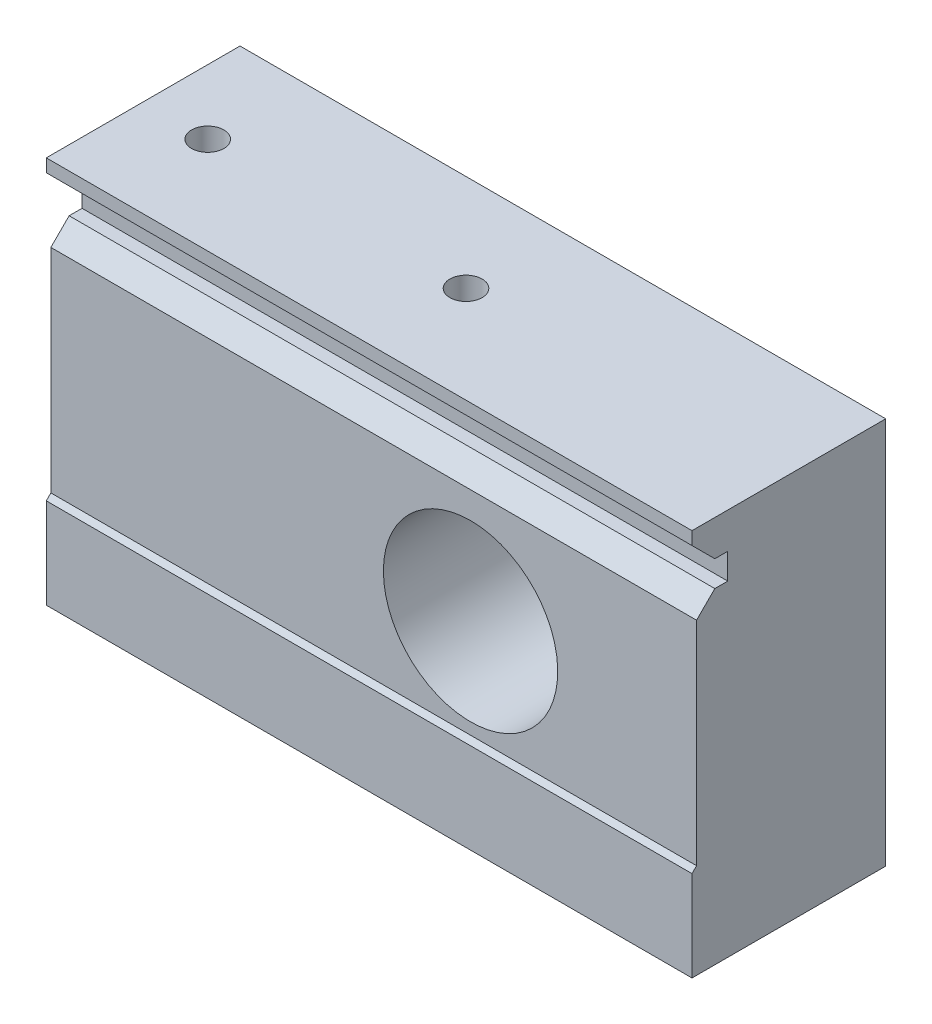
ISO-10303-21;
HEADER;
FILE_DESCRIPTION(('STEP AP214'),'2;1');
FILE_NAME('part.step','',(''),(''),'','','');
FILE_SCHEMA(('AUTOMOTIVE_DESIGN { 1 0 10303 214 1 1 1 1 }'));
ENDSEC;
DATA;
#1=APPLICATION_CONTEXT('core data for automotive mechanical design processes');
#2=APPLICATION_PROTOCOL_DEFINITION('international standard','automotive_design',2000,#1);
#3=PRODUCT_CONTEXT('',#1,'mechanical');
#4=PRODUCT('Part','Part','',(#3));
#5=PRODUCT_RELATED_PRODUCT_CATEGORY('part','',(#4));
#6=PRODUCT_DEFINITION_FORMATION('','',#4);
#7=PRODUCT_DEFINITION_CONTEXT('part definition',#1,'design');
#8=PRODUCT_DEFINITION('design','',#6,#7);
#9=PRODUCT_DEFINITION_SHAPE('','',#8);
#10=(LENGTH_UNIT() NAMED_UNIT(*) SI_UNIT(.MILLI.,.METRE.));
#11=(NAMED_UNIT(*) PLANE_ANGLE_UNIT() SI_UNIT($,.RADIAN.));
#12=(NAMED_UNIT(*) SI_UNIT($,.STERADIAN.) SOLID_ANGLE_UNIT());
#13=UNCERTAINTY_MEASURE_WITH_UNIT(LENGTH_MEASURE(1.E-05),#10,'distance_accuracy_value','');
#14=(GEOMETRIC_REPRESENTATION_CONTEXT(3) GLOBAL_UNCERTAINTY_ASSIGNED_CONTEXT((#13)) GLOBAL_UNIT_ASSIGNED_CONTEXT((#10,
#11,#12)) REPRESENTATION_CONTEXT('',''));
#15=CARTESIAN_POINT('',(0.,0.,0.));
#16=DIRECTION('',(0.,0.,1.));
#17=DIRECTION('',(1.,0.,0.));
#18=AXIS2_PLACEMENT_3D('',#15,#16,#17);
#19=CARTESIAN_POINT('',(0.,0.,30.));
#20=DIRECTION('',(0.,0.,1.));
#21=DIRECTION('',(1.,0.,0.));
#22=AXIS2_PLACEMENT_3D('',#19,#20,#21);
#23=PLANE('',#22);
#24=DIRECTION('',(1.,0.,0.));
#25=VECTOR('',#24,1.);
#26=CARTESIAN_POINT('',(0.,-16.4851485148515,30.));
#27=LINE('',#26,#25);
#28=CARTESIAN_POINT('',(-47.9207920792079,-16.4851485148515,30.));
#29=VERTEX_POINT('',#28);
#30=CARTESIAN_POINT('',(52.0792079207921,-16.4851485148515,30.));
#31=VERTEX_POINT('',#30);
#32=EDGE_CURVE('E158',#29,#31,#27,.T.);
#33=ORIENTED_EDGE('',*,*,#32,.F.);
#34=DIRECTION('',(0.,-1.,0.));
#35=VECTOR('',#34,1.);
#36=CARTESIAN_POINT('',(-47.9207920792079,29.5148514851485,30.));
#37=LINE('',#36,#35);
#38=CARTESIAN_POINT('',(-47.9207920792079,-30.4851485148515,30.));
#39=VERTEX_POINT('',#38);
#40=EDGE_CURVE('E105',#29,#39,#37,.T.);
#41=ORIENTED_EDGE('',*,*,#40,.T.);
#42=DIRECTION('',(1.,0.,0.));
#43=VECTOR('',#42,1.);
#44=CARTESIAN_POINT('',(-47.9207920792079,-30.4851485148515,30.));
#45=LINE('',#44,#43);
#46=CARTESIAN_POINT('',(52.0792079207921,-30.4851485148515,30.));
#47=VERTEX_POINT('',#46);
#48=EDGE_CURVE('E172',#39,#47,#45,.T.);
#49=ORIENTED_EDGE('',*,*,#48,.T.);
#50=DIRECTION('',(0.,1.,0.));
#51=VECTOR('',#50,1.);
#52=CARTESIAN_POINT('',(52.0792079207921,29.5148514851485,30.));
#53=LINE('',#52,#51);
#54=EDGE_CURVE('E182',#47,#31,#53,.T.);
#55=ORIENTED_EDGE('',*,*,#54,.T.);
#56=EDGE_LOOP('',(#33,#41,#49,#55));
#57=FACE_BOUND('',#56,.T.);
#58=ADVANCED_FACE('F50',(#57),#23,.T.);
#59=CARTESIAN_POINT('',(-47.9207920792079,29.5148514851485,30.));
#60=DIRECTION('',(1.,0.,0.));
#61=DIRECTION('',(0.,1.,0.));
#62=AXIS2_PLACEMENT_3D('',#59,#60,#61);
#63=PLANE('',#62);
#64=ORIENTED_EDGE('',*,*,#40,.F.);
#65=DIRECTION('',(0.,-0.707106781186546,0.707106781186549));
#66=VECTOR('',#65,1.);
#67=CARTESIAN_POINT('',(-47.9207920792079,-16.4851485148515,30.));
#68=LINE('',#67,#66);
#69=CARTESIAN_POINT('',(-47.9207920792079,-15.7780417336649,29.2928932188135));
#70=VERTEX_POINT('',#69);
#71=EDGE_CURVE('E261',#70,#29,#68,.T.);
#72=ORIENTED_EDGE('',*,*,#71,.F.);
#73=DIRECTION('',(0.,-1.,0.));
#74=VECTOR('',#73,1.);
#75=CARTESIAN_POINT('',(-47.9207920792079,-15.7780417336649,29.2928932188135));
#76=LINE('',#75,#74);
#77=CARTESIAN_POINT('',(-47.9207920792079,17.1508904544696,29.2928932188135));
#78=VERTEX_POINT('',#77);
#79=EDGE_CURVE('E271',#78,#70,#76,.T.);
#80=ORIENTED_EDGE('',*,*,#79,.F.);
#81=DIRECTION('',(0.,-0.707106781186546,0.707106781186549));
#82=VECTOR('',#81,1.);
#83=CARTESIAN_POINT('',(-47.9207920792079,17.1508904544696,29.2928932188135));
#84=LINE('',#83,#82);
#85=CARTESIAN_POINT('',(-47.9207920792079,19.9793175792158,26.4644660940673));
#86=VERTEX_POINT('',#85);
#87=EDGE_CURVE('E274',#86,#78,#84,.T.);
#88=ORIENTED_EDGE('',*,*,#87,.F.);
#89=DIRECTION('',(0.,0.,1.));
#90=VECTOR('',#89,1.);
#91=CARTESIAN_POINT('',(-47.9207920792079,19.9793175792158,26.4644660940673));
#92=LINE('',#91,#90);
#93=CARTESIAN_POINT('',(-47.9207920792079,19.9793175792158,24.4644660940673));
#94=VERTEX_POINT('',#93);
#95=EDGE_CURVE('E244',#94,#86,#92,.T.);
#96=ORIENTED_EDGE('',*,*,#95,.F.);
#97=DIRECTION('',(0.,-1.,0.));
#98=VECTOR('',#97,1.);
#99=CARTESIAN_POINT('',(-47.9207920792079,19.9793175792158,24.4644660940673));
#100=LINE('',#99,#98);
#101=CARTESIAN_POINT('',(-47.9207920792079,23.9793175792158,24.4644660940673));
#102=VERTEX_POINT('',#101);
#103=EDGE_CURVE('E279',#102,#94,#100,.T.);
#104=ORIENTED_EDGE('',*,*,#103,.F.);
#105=DIRECTION('',(0.,0.,-1.));
#106=VECTOR('',#105,1.);
#107=CARTESIAN_POINT('',(-47.9207920792079,23.9793175792158,24.4644660940673));
#108=LINE('',#107,#106);
#109=CARTESIAN_POINT('',(-47.9207920792079,23.9793175792158,26.4644660940673));
#110=VERTEX_POINT('',#109);
#111=EDGE_CURVE('E166',#110,#102,#108,.T.);
#112=ORIENTED_EDGE('',*,*,#111,.F.);
#113=DIRECTION('',(0.,-0.707106781186549,-0.707106781186546));
#114=VECTOR('',#113,1.);
#115=CARTESIAN_POINT('',(-47.9207920792079,23.9793175792158,26.4644660940673));
#116=LINE('',#115,#114);
#117=CARTESIAN_POINT('',(-47.9207920792079,27.5148514851485,30.));
#118=VERTEX_POINT('',#117);
#119=EDGE_CURVE('E154',#118,#110,#116,.T.);
#120=ORIENTED_EDGE('',*,*,#119,.F.);
#121=CARTESIAN_POINT('',(-47.9207920792079,29.5148514851485,30.));
#122=VERTEX_POINT('',#121);
#123=EDGE_CURVE('E163',#122,#118,#37,.T.);
#124=ORIENTED_EDGE('',*,*,#123,.F.);
#125=DIRECTION('',(0.,0.,-1.));
#126=VECTOR('',#125,1.);
#127=CARTESIAN_POINT('',(-47.9207920792079,29.5148514851485,30.));
#128=LINE('',#127,#126);
#129=CARTESIAN_POINT('',(-47.9207920792079,29.5148514851485,0.));
#130=VERTEX_POINT('',#129);
#131=EDGE_CURVE('E188',#122,#130,#128,.T.);
#132=ORIENTED_EDGE('',*,*,#131,.T.);
#133=DIRECTION('',(0.,-1.,0.));
#134=VECTOR('',#133,1.);
#135=CARTESIAN_POINT('',(-47.9207920792079,29.5148514851485,0.));
#136=LINE('',#135,#134);
#137=CARTESIAN_POINT('',(-47.9207920792079,-30.4851485148515,0.));
#138=VERTEX_POINT('',#137);
#139=EDGE_CURVE('E189',#130,#138,#136,.T.);
#140=ORIENTED_EDGE('',*,*,#139,.T.);
#141=DIRECTION('',(0.,0.,-1.));
#142=VECTOR('',#141,1.);
#143=CARTESIAN_POINT('',(-47.9207920792079,-30.4851485148515,30.));
#144=LINE('',#143,#142);
#145=EDGE_CURVE('E159',#39,#138,#144,.T.);
#146=ORIENTED_EDGE('',*,*,#145,.F.);
#147=EDGE_LOOP('',(#64,#72,#80,#88,#96,#104,#112,#120,#124,#132,#140,#146));
#148=FACE_BOUND('',#147,.T.);
#149=ADVANCED_FACE('F52',(#148),#63,.F.);
#150=CARTESIAN_POINT('',(-47.9207920792079,-30.4851485148515,30.));
#151=DIRECTION('',(0.,1.,0.));
#152=DIRECTION('',(0.,0.,1.));
#153=AXIS2_PLACEMENT_3D('',#150,#151,#152);
#154=PLANE('',#153);
#155=CARTESIAN_POINT('',(2.07920792079211,-30.4851485148515,15.));
#156=DIRECTION('',(0.,1.,0.));
#157=DIRECTION('',(0.,0.,1.));
#158=AXIS2_PLACEMENT_3D('',#155,#156,#157);
#159=CIRCLE('',#158,2.5);
#160=CARTESIAN_POINT('',(2.07920792079211,-30.4851485148515,17.5));
#161=VERTEX_POINT('',#160);
#162=EDGE_CURVE('E289',#161,#161,#159,.T.);
#163=ORIENTED_EDGE('',*,*,#162,.T.);
#164=EDGE_LOOP('',(#163));
#165=FACE_BOUND('',#164,.T.);
#166=CARTESIAN_POINT('',(-37.9207920792079,-30.4851485148515,15.));
#167=DIRECTION('',(0.,1.,0.));
#168=DIRECTION('',(0.,0.,1.));
#169=AXIS2_PLACEMENT_3D('',#166,#167,#168);
#170=CIRCLE('',#169,2.5);
#171=CARTESIAN_POINT('',(-37.9207920792079,-30.4851485148515,17.5));
#172=VERTEX_POINT('',#171);
#173=EDGE_CURVE('E298',#172,#172,#170,.T.);
#174=ORIENTED_EDGE('',*,*,#173,.T.);
#175=EDGE_LOOP('',(#174));
#176=FACE_BOUND('',#175,.T.);
#177=DIRECTION('',(1.,0.,0.));
#178=VECTOR('',#177,1.);
#179=CARTESIAN_POINT('',(-47.9207920792079,-30.4851485148515,0.));
#180=LINE('',#179,#178);
#181=CARTESIAN_POINT('',(52.0792079207921,-30.4851485148515,0.));
#182=VERTEX_POINT('',#181);
#183=EDGE_CURVE('E193',#138,#182,#180,.T.);
#184=ORIENTED_EDGE('',*,*,#183,.T.);
#185=DIRECTION('',(0.,0.,-1.));
#186=VECTOR('',#185,1.);
#187=CARTESIAN_POINT('',(52.0792079207921,-30.4851485148515,30.));
#188=LINE('',#187,#186);
#189=EDGE_CURVE('E206',#47,#182,#188,.T.);
#190=ORIENTED_EDGE('',*,*,#189,.F.);
#191=ORIENTED_EDGE('',*,*,#48,.F.);
#192=ORIENTED_EDGE('',*,*,#145,.T.);
#193=EDGE_LOOP('',(#184,#190,#191,#192));
#194=FACE_BOUND('',#193,.T.);
#195=ADVANCED_FACE('F330',(#165,#176,#194),#154,.F.);
#196=CARTESIAN_POINT('',(52.0792079207921,29.5148514851485,30.));
#197=DIRECTION('',(-1.,0.,0.));
#198=DIRECTION('',(0.,-1.,0.));
#199=AXIS2_PLACEMENT_3D('',#196,#197,#198);
#200=PLANE('',#199);
#201=DIRECTION('',(0.,-1.,0.));
#202=VECTOR('',#201,1.);
#203=CARTESIAN_POINT('',(52.0792079207921,29.5148514851485,29.2928932188135));
#204=LINE('',#203,#202);
#205=CARTESIAN_POINT('',(52.0792079207921,17.1508904544696,29.2928932188135));
#206=VERTEX_POINT('',#205);
#207=CARTESIAN_POINT('',(52.0792079207921,-15.7780417336649,29.2928932188135));
#208=VERTEX_POINT('',#207);
#209=EDGE_CURVE('E12',#206,#208,#204,.T.);
#210=ORIENTED_EDGE('',*,*,#209,.T.);
#211=DIRECTION('',(0.,-0.707106781186546,0.707106781186549));
#212=VECTOR('',#211,1.);
#213=CARTESIAN_POINT('',(52.0792079207921,6.51485148514841,7.00000000000001));
#214=LINE('',#213,#212);
#215=EDGE_CURVE('E179',#208,#31,#214,.T.);
#216=ORIENTED_EDGE('',*,*,#215,.T.);
#217=ORIENTED_EDGE('',*,*,#54,.F.);
#218=ORIENTED_EDGE('',*,*,#189,.T.);
#219=DIRECTION('',(0.,1.,0.));
#220=VECTOR('',#219,1.);
#221=CARTESIAN_POINT('',(52.0792079207921,29.5148514851485,0.));
#222=LINE('',#221,#220);
#223=CARTESIAN_POINT('',(52.0792079207921,29.5148514851485,0.));
#224=VERTEX_POINT('',#223);
#225=EDGE_CURVE('E196',#182,#224,#222,.T.);
#226=ORIENTED_EDGE('',*,*,#225,.T.);
#227=DIRECTION('',(0.,0.,-1.));
#228=VECTOR('',#227,1.);
#229=CARTESIAN_POINT('',(52.0792079207921,29.5148514851485,30.));
#230=LINE('',#229,#228);
#231=CARTESIAN_POINT('',(52.0792079207921,29.5148514851485,30.));
#232=VERTEX_POINT('',#231);
#233=EDGE_CURVE('E203',#232,#224,#230,.T.);
#234=ORIENTED_EDGE('',*,*,#233,.F.);
#235=CARTESIAN_POINT('',(52.0792079207921,27.5148514851485,30.));
#236=VERTEX_POINT('',#235);
#237=EDGE_CURVE('E176',#236,#232,#53,.T.);
#238=ORIENTED_EDGE('',*,*,#237,.F.);
#239=DIRECTION('',(0.,-0.707106781186549,-0.707106781186546));
#240=VECTOR('',#239,1.);
#241=CARTESIAN_POINT('',(52.0792079207921,28.5148514851485,31.));
#242=LINE('',#241,#240);
#243=CARTESIAN_POINT('',(52.0792079207921,23.9793175792158,26.4644660940673));
#244=VERTEX_POINT('',#243);
#245=EDGE_CURVE('E67',#236,#244,#242,.T.);
#246=ORIENTED_EDGE('',*,*,#245,.T.);
#247=DIRECTION('',(0.,0.,-1.));
#248=VECTOR('',#247,1.);
#249=CARTESIAN_POINT('',(52.0792079207921,23.9793175792158,30.));
#250=LINE('',#249,#248);
#251=CARTESIAN_POINT('',(52.0792079207921,23.9793175792158,24.4644660940673));
#252=VERTEX_POINT('',#251);
#253=EDGE_CURVE('E215',#244,#252,#250,.T.);
#254=ORIENTED_EDGE('',*,*,#253,.T.);
#255=DIRECTION('',(0.,-1.,0.));
#256=VECTOR('',#255,1.);
#257=CARTESIAN_POINT('',(52.0792079207921,29.5148514851485,24.4644660940673));
#258=LINE('',#257,#256);
#259=CARTESIAN_POINT('',(52.0792079207921,19.9793175792158,24.4644660940673));
#260=VERTEX_POINT('',#259);
#261=EDGE_CURVE('E219',#252,#260,#258,.T.);
#262=ORIENTED_EDGE('',*,*,#261,.T.);
#263=DIRECTION('',(0.,0.,1.));
#264=VECTOR('',#263,1.);
#265=CARTESIAN_POINT('',(52.0792079207921,19.9793175792158,30.));
#266=LINE('',#265,#264);
#267=CARTESIAN_POINT('',(52.0792079207921,19.9793175792158,26.4644660940673));
#268=VERTEX_POINT('',#267);
#269=EDGE_CURVE('E223',#260,#268,#266,.T.);
#270=ORIENTED_EDGE('',*,*,#269,.T.);
#271=DIRECTION('',(0.,-0.707106781186546,0.707106781186549));
#272=VECTOR('',#271,1.);
#273=CARTESIAN_POINT('',(52.0792079207921,22.9793175792158,23.4644660940673));
#274=LINE('',#273,#272);
#275=EDGE_CURVE('E60',#268,#206,#274,.T.);
#276=ORIENTED_EDGE('',*,*,#275,.T.);
#277=EDGE_LOOP('',(#210,#216,#217,#218,#226,#234,#238,#246,#254,#262,#270,#276));
#278=FACE_BOUND('',#277,.T.);
#279=ADVANCED_FACE('F230',(#278),#200,.F.);
#280=CARTESIAN_POINT('',(-47.9207920792079,29.5148514851485,30.));
#281=DIRECTION('',(0.,-1.,0.));
#282=DIRECTION('',(0.,0.,-1.));
#283=AXIS2_PLACEMENT_3D('',#280,#281,#282);
#284=PLANE('',#283);
#285=CARTESIAN_POINT('',(-37.9207920792079,29.5148514851485,15.));
#286=DIRECTION('',(0.,1.,0.));
#287=DIRECTION('',(0.,0.,1.));
#288=AXIS2_PLACEMENT_3D('',#285,#286,#287);
#289=CIRCLE('',#288,2.5);
#290=CARTESIAN_POINT('',(-37.9207920792079,29.5148514851485,17.5));
#291=VERTEX_POINT('',#290);
#292=EDGE_CURVE('E317',#291,#291,#289,.T.);
#293=ORIENTED_EDGE('',*,*,#292,.F.);
#294=EDGE_LOOP('',(#293));
#295=FACE_BOUND('',#294,.T.);
#296=CARTESIAN_POINT('',(2.07920792079211,29.5148514851485,15.));
#297=DIRECTION('',(0.,1.,0.));
#298=DIRECTION('',(0.,0.,1.));
#299=AXIS2_PLACEMENT_3D('',#296,#297,#298);
#300=CIRCLE('',#299,2.5);
#301=CARTESIAN_POINT('',(2.07920792079211,29.5148514851485,17.5));
#302=VERTEX_POINT('',#301);
#303=EDGE_CURVE('E285',#302,#302,#300,.T.);
#304=ORIENTED_EDGE('',*,*,#303,.F.);
#305=EDGE_LOOP('',(#304));
#306=FACE_BOUND('',#305,.T.);
#307=DIRECTION('',(-1.,0.,0.));
#308=VECTOR('',#307,1.);
#309=CARTESIAN_POINT('',(-47.9207920792079,29.5148514851485,0.));
#310=LINE('',#309,#308);
#311=EDGE_CURVE('E97',#224,#130,#310,.T.);
#312=ORIENTED_EDGE('',*,*,#311,.T.);
#313=ORIENTED_EDGE('',*,*,#131,.F.);
#314=DIRECTION('',(-1.,0.,0.));
#315=VECTOR('',#314,1.);
#316=CARTESIAN_POINT('',(-47.9207920792079,29.5148514851485,30.));
#317=LINE('',#316,#315);
#318=EDGE_CURVE('E76',#232,#122,#317,.T.);
#319=ORIENTED_EDGE('',*,*,#318,.F.);
#320=ORIENTED_EDGE('',*,*,#233,.T.);
#321=EDGE_LOOP('',(#312,#313,#319,#320));
#322=FACE_BOUND('',#321,.T.);
#323=ADVANCED_FACE('F360',(#295,#306,#322),#284,.F.);
#324=DIRECTION('',(-1.,0.,0.));
#325=VECTOR('',#324,1.);
#326=CARTESIAN_POINT('',(0.,27.5148514851485,30.));
#327=LINE('',#326,#325);
#328=EDGE_CURVE('E151',#236,#118,#327,.T.);
#329=ORIENTED_EDGE('',*,*,#328,.F.);
#330=ORIENTED_EDGE('',*,*,#237,.T.);
#331=ORIENTED_EDGE('',*,*,#318,.T.);
#332=ORIENTED_EDGE('',*,*,#123,.T.);
#333=EDGE_LOOP('',(#329,#330,#331,#332));
#334=FACE_BOUND('',#333,.T.);
#335=ADVANCED_FACE('F170',(#334),#23,.T.);
#336=CARTESIAN_POINT('',(0.,0.,0.));
#337=DIRECTION('',(0.,0.,1.));
#338=DIRECTION('',(1.,0.,0.));
#339=AXIS2_PLACEMENT_3D('',#336,#337,#338);
#340=PLANE('',#339);
#341=CARTESIAN_POINT('',(17.0792079207921,-0.485148514851486,0.));
#342=DIRECTION('',(0.,0.,-1.));
#343=DIRECTION('',(-1.,0.,0.));
#344=AXIS2_PLACEMENT_3D('',#341,#342,#343);
#345=CIRCLE('',#344,13.5);
#346=CARTESIAN_POINT('',(3.57920792079213,-0.485148514851486,0.));
#347=VERTEX_POINT('',#346);
#348=EDGE_CURVE('E309',#347,#347,#345,.T.);
#349=ORIENTED_EDGE('',*,*,#348,.F.);
#350=EDGE_LOOP('',(#349));
#351=FACE_BOUND('',#350,.T.);
#352=ORIENTED_EDGE('',*,*,#139,.F.);
#353=ORIENTED_EDGE('',*,*,#311,.F.);
#354=ORIENTED_EDGE('',*,*,#225,.F.);
#355=ORIENTED_EDGE('',*,*,#183,.F.);
#356=EDGE_LOOP('',(#352,#353,#354,#355));
#357=FACE_BOUND('',#356,.T.);
#358=ADVANCED_FACE('F359',(#351,#357),#340,.F.);
#359=CARTESIAN_POINT('',(62.0792079207921,-15.7780417336649,29.2928932188135));
#360=DIRECTION('',(0.,0.,-1.));
#361=DIRECTION('',(0.,1.,0.));
#362=AXIS2_PLACEMENT_3D('',#359,#360,#361);
#363=PLANE('',#362);
#364=CARTESIAN_POINT('',(17.0792079207921,-0.485148514851486,29.2928932188135));
#365=DIRECTION('',(0.,0.,-1.));
#366=DIRECTION('',(0.,1.,0.));
#367=AXIS2_PLACEMENT_3D('',#364,#365,#366);
#368=CIRCLE('',#367,13.5);
#369=CARTESIAN_POINT('',(17.0792079207921,13.0148514851485,29.2928932188135));
#370=VERTEX_POINT('',#369);
#371=EDGE_CURVE('E54',#370,#370,#368,.T.);
#372=ORIENTED_EDGE('',*,*,#371,.T.);
#373=EDGE_LOOP('',(#372));
#374=FACE_BOUND('',#373,.T.);
#375=DIRECTION('',(-1.,0.,0.));
#376=VECTOR('',#375,1.);
#377=CARTESIAN_POINT('',(62.0792079207921,17.1508904544696,29.2928932188135));
#378=LINE('',#377,#376);
#379=EDGE_CURVE('E239',#206,#78,#378,.T.);
#380=ORIENTED_EDGE('',*,*,#379,.T.);
#381=ORIENTED_EDGE('',*,*,#79,.T.);
#382=DIRECTION('',(-1.,0.,0.));
#383=VECTOR('',#382,1.);
#384=CARTESIAN_POINT('',(62.0792079207921,-15.7780417336649,29.2928932188135));
#385=LINE('',#384,#383);
#386=EDGE_CURVE('E251',#208,#70,#385,.T.);
#387=ORIENTED_EDGE('',*,*,#386,.F.);
#388=ORIENTED_EDGE('',*,*,#209,.F.);
#389=EDGE_LOOP('',(#380,#381,#387,#388));
#390=FACE_BOUND('',#389,.T.);
#391=ADVANCED_FACE('F365',(#374,#390),#363,.F.);
#392=CARTESIAN_POINT('',(62.0792079207921,17.1508904544696,29.2928932188135));
#393=DIRECTION('',(0.,-0.707106781186549,-0.707106781186546));
#394=DIRECTION('',(0.,0.707106781186546,-0.707106781186549));
#395=AXIS2_PLACEMENT_3D('',#392,#393,#394);
#396=PLANE('',#395);
#397=DIRECTION('',(-1.,0.,0.));
#398=VECTOR('',#397,1.);
#399=CARTESIAN_POINT('',(62.0792079207921,19.9793175792158,26.4644660940673));
#400=LINE('',#399,#398);
#401=EDGE_CURVE('E237',#268,#86,#400,.T.);
#402=ORIENTED_EDGE('',*,*,#401,.T.);
#403=ORIENTED_EDGE('',*,*,#87,.T.);
#404=ORIENTED_EDGE('',*,*,#379,.F.);
#405=ORIENTED_EDGE('',*,*,#275,.F.);
#406=EDGE_LOOP('',(#402,#403,#404,#405));
#407=FACE_BOUND('',#406,.T.);
#408=ADVANCED_FACE('F235',(#407),#396,.F.);
#409=CARTESIAN_POINT('',(62.0792079207921,19.9793175792158,26.4644660940673));
#410=DIRECTION('',(0.,-1.,0.));
#411=DIRECTION('',(0.,0.,-1.));
#412=AXIS2_PLACEMENT_3D('',#409,#410,#411);
#413=PLANE('',#412);
#414=DIRECTION('',(-1.,0.,0.));
#415=VECTOR('',#414,1.);
#416=CARTESIAN_POINT('',(62.0792079207921,19.9793175792158,24.4644660940673));
#417=LINE('',#416,#415);
#418=EDGE_CURVE('E247',#260,#94,#417,.T.);
#419=ORIENTED_EDGE('',*,*,#418,.T.);
#420=ORIENTED_EDGE('',*,*,#95,.T.);
#421=ORIENTED_EDGE('',*,*,#401,.F.);
#422=ORIENTED_EDGE('',*,*,#269,.F.);
#423=EDGE_LOOP('',(#419,#420,#421,#422));
#424=FACE_BOUND('',#423,.T.);
#425=ADVANCED_FACE('F241',(#424),#413,.F.);
#426=CARTESIAN_POINT('',(62.0792079207921,19.9793175792158,24.4644660940673));
#427=DIRECTION('',(0.,0.,-1.));
#428=DIRECTION('',(-1.,0.,0.));
#429=AXIS2_PLACEMENT_3D('',#426,#427,#428);
#430=PLANE('',#429);
#431=DIRECTION('',(-1.,0.,0.));
#432=VECTOR('',#431,1.);
#433=CARTESIAN_POINT('',(62.0792079207921,23.9793175792158,24.4644660940673));
#434=LINE('',#433,#432);
#435=EDGE_CURVE('E253',#252,#102,#434,.T.);
#436=ORIENTED_EDGE('',*,*,#435,.T.);
#437=ORIENTED_EDGE('',*,*,#103,.T.);
#438=ORIENTED_EDGE('',*,*,#418,.F.);
#439=ORIENTED_EDGE('',*,*,#261,.F.);
#440=EDGE_LOOP('',(#436,#437,#438,#439));
#441=FACE_BOUND('',#440,.T.);
#442=ADVANCED_FACE('F421',(#441),#430,.F.);
#443=CARTESIAN_POINT('',(62.0792079207921,23.9793175792158,24.4644660940673));
#444=DIRECTION('',(0.,1.,0.));
#445=DIRECTION('',(-1.,0.,0.));
#446=AXIS2_PLACEMENT_3D('',#443,#444,#445);
#447=PLANE('',#446);
#448=DIRECTION('',(-1.,0.,0.));
#449=VECTOR('',#448,1.);
#450=CARTESIAN_POINT('',(62.0792079207921,23.9793175792158,26.4644660940673));
#451=LINE('',#450,#449);
#452=EDGE_CURVE('E259',#244,#110,#451,.T.);
#453=ORIENTED_EDGE('',*,*,#452,.T.);
#454=ORIENTED_EDGE('',*,*,#111,.T.);
#455=ORIENTED_EDGE('',*,*,#435,.F.);
#456=ORIENTED_EDGE('',*,*,#253,.F.);
#457=EDGE_LOOP('',(#453,#454,#455,#456));
#458=FACE_BOUND('',#457,.T.);
#459=ADVANCED_FACE('F413',(#458),#447,.F.);
#460=CARTESIAN_POINT('',(62.0792079207921,-16.4851485148515,30.));
#461=DIRECTION('',(0.,-0.707106781186549,-0.707106781186546));
#462=DIRECTION('',(0.,0.707106781186546,-0.707106781186549));
#463=AXIS2_PLACEMENT_3D('',#460,#461,#462);
#464=PLANE('',#463);
#465=ORIENTED_EDGE('',*,*,#386,.T.);
#466=ORIENTED_EDGE('',*,*,#71,.T.);
#467=ORIENTED_EDGE('',*,*,#32,.T.);
#468=ORIENTED_EDGE('',*,*,#215,.F.);
#469=EDGE_LOOP('',(#465,#466,#467,#468));
#470=FACE_BOUND('',#469,.T.);
#471=ADVANCED_FACE('F410',(#470),#464,.F.);
#472=CARTESIAN_POINT('',(62.0792079207921,23.9793175792158,26.4644660940673));
#473=DIRECTION('',(0.,0.707106781186546,-0.707106781186549));
#474=DIRECTION('',(0.,0.707106781186549,0.707106781186546));
#475=AXIS2_PLACEMENT_3D('',#472,#473,#474);
#476=PLANE('',#475);
#477=ORIENTED_EDGE('',*,*,#328,.T.);
#478=ORIENTED_EDGE('',*,*,#119,.T.);
#479=ORIENTED_EDGE('',*,*,#452,.F.);
#480=ORIENTED_EDGE('',*,*,#245,.F.);
#481=EDGE_LOOP('',(#477,#478,#479,#480));
#482=FACE_BOUND('',#481,.T.);
#483=ADVANCED_FACE('F153',(#482),#476,.F.);
#484=CARTESIAN_POINT('',(2.07920792079211,19.5148514851485,15.));
#485=DIRECTION('',(0.,1.,0.));
#486=DIRECTION('',(0.,0.,1.));
#487=AXIS2_PLACEMENT_3D('',#484,#485,#486);
#488=CYLINDRICAL_SURFACE('',#487,2.5);
#489=CARTESIAN_POINT('',(2.07920792079211,19.5148514851485,15.));
#490=DIRECTION('',(0.,1.,0.));
#491=DIRECTION('',(0.,0.,1.));
#492=AXIS2_PLACEMENT_3D('',#489,#490,#491);
#493=CIRCLE('',#492,2.5);
#494=CARTESIAN_POINT('',(2.07920792079211,19.5148514851485,17.5));
#495=VERTEX_POINT('',#494);
#496=EDGE_CURVE('E168',#495,#495,#493,.T.);
#497=ORIENTED_EDGE('',*,*,#496,.F.);
#498=EDGE_LOOP('',(#497));
#499=FACE_BOUND('',#498,.T.);
#500=ORIENTED_EDGE('',*,*,#303,.T.);
#501=EDGE_LOOP('',(#500));
#502=FACE_BOUND('',#501,.T.);
#503=ADVANCED_FACE('F400',(#499,#502),#488,.F.);
#504=CARTESIAN_POINT('',(2.07920792079211,19.5148514851485,15.));
#505=DIRECTION('',(0.,1.,0.));
#506=DIRECTION('',(0.,0.,1.));
#507=AXIS2_PLACEMENT_3D('',#504,#505,#506);
#508=PLANE('',#507);
#509=ORIENTED_EDGE('',*,*,#496,.T.);
#510=EDGE_LOOP('',(#509));
#511=FACE_BOUND('',#510,.T.);
#512=ADVANCED_FACE('F395',(#511),#508,.T.);
#513=CARTESIAN_POINT('',(-37.9207920792079,19.5148514851485,15.));
#514=DIRECTION('',(0.,1.,0.));
#515=DIRECTION('',(0.,0.,1.));
#516=AXIS2_PLACEMENT_3D('',#513,#514,#515);
#517=CYLINDRICAL_SURFACE('',#516,2.5);
#518=CARTESIAN_POINT('',(-37.9207920792079,19.5148514851485,15.));
#519=DIRECTION('',(0.,1.,0.));
#520=DIRECTION('',(0.,0.,1.));
#521=AXIS2_PLACEMENT_3D('',#518,#519,#520);
#522=CIRCLE('',#521,2.5);
#523=CARTESIAN_POINT('',(-37.9207920792079,19.5148514851485,17.5));
#524=VERTEX_POINT('',#523);
#525=EDGE_CURVE('E314',#524,#524,#522,.T.);
#526=ORIENTED_EDGE('',*,*,#525,.F.);
#527=EDGE_LOOP('',(#526));
#528=FACE_BOUND('',#527,.T.);
#529=ORIENTED_EDGE('',*,*,#292,.T.);
#530=EDGE_LOOP('',(#529));
#531=FACE_BOUND('',#530,.T.);
#532=ADVANCED_FACE('F392',(#528,#531),#517,.F.);
#533=CARTESIAN_POINT('',(-37.9207920792079,19.5148514851485,15.));
#534=DIRECTION('',(0.,1.,0.));
#535=DIRECTION('',(0.,0.,1.));
#536=AXIS2_PLACEMENT_3D('',#533,#534,#535);
#537=PLANE('',#536);
#538=ORIENTED_EDGE('',*,*,#525,.T.);
#539=EDGE_LOOP('',(#538));
#540=FACE_BOUND('',#539,.T.);
#541=ADVANCED_FACE('F337',(#540),#537,.T.);
#542=CARTESIAN_POINT('',(-37.9207920792079,-30.4851485148515,15.));
#543=DIRECTION('',(0.,1.,0.));
#544=DIRECTION('',(0.,0.,1.));
#545=AXIS2_PLACEMENT_3D('',#542,#543,#544);
#546=CYLINDRICAL_SURFACE('',#545,2.5);
#547=ORIENTED_EDGE('',*,*,#173,.F.);
#548=EDGE_LOOP('',(#547));
#549=FACE_BOUND('',#548,.T.);
#550=CARTESIAN_POINT('',(-37.9207920792079,-20.4851485148515,15.));
#551=DIRECTION('',(0.,1.,0.));
#552=DIRECTION('',(0.,0.,1.));
#553=AXIS2_PLACEMENT_3D('',#550,#551,#552);
#554=CIRCLE('',#553,2.5);
#555=CARTESIAN_POINT('',(-37.9207920792079,-20.4851485148515,17.5));
#556=VERTEX_POINT('',#555);
#557=EDGE_CURVE('E293',#556,#556,#554,.T.);
#558=ORIENTED_EDGE('',*,*,#557,.T.);
#559=EDGE_LOOP('',(#558));
#560=FACE_BOUND('',#559,.T.);
#561=ADVANCED_FACE('F333',(#549,#560),#546,.F.);
#562=CARTESIAN_POINT('',(-37.9207920792079,-20.4851485148515,15.));
#563=DIRECTION('',(0.,1.,0.));
#564=DIRECTION('',(0.,0.,1.));
#565=AXIS2_PLACEMENT_3D('',#562,#563,#564);
#566=PLANE('',#565);
#567=ORIENTED_EDGE('',*,*,#557,.F.);
#568=EDGE_LOOP('',(#567));
#569=FACE_BOUND('',#568,.T.);
#570=ADVANCED_FACE('F336',(#569),#566,.F.);
#571=CARTESIAN_POINT('',(2.07920792079211,-30.4851485148515,15.));
#572=DIRECTION('',(0.,1.,0.));
#573=DIRECTION('',(0.,0.,1.));
#574=AXIS2_PLACEMENT_3D('',#571,#572,#573);
#575=CYLINDRICAL_SURFACE('',#574,2.5);
#576=ORIENTED_EDGE('',*,*,#162,.F.);
#577=EDGE_LOOP('',(#576));
#578=FACE_BOUND('',#577,.T.);
#579=CARTESIAN_POINT('',(2.07920792079211,-20.4851485148515,15.));
#580=DIRECTION('',(0.,1.,0.));
#581=DIRECTION('',(0.,0.,1.));
#582=AXIS2_PLACEMENT_3D('',#579,#580,#581);
#583=CIRCLE('',#582,2.5);
#584=CARTESIAN_POINT('',(2.07920792079211,-20.4851485148515,17.5));
#585=VERTEX_POINT('',#584);
#586=EDGE_CURVE('E308',#585,#585,#583,.T.);
#587=ORIENTED_EDGE('',*,*,#586,.T.);
#588=EDGE_LOOP('',(#587));
#589=FACE_BOUND('',#588,.T.);
#590=ADVANCED_FACE('F342',(#578,#589),#575,.F.);
#591=CARTESIAN_POINT('',(2.07920792079211,-20.4851485148515,15.));
#592=DIRECTION('',(0.,1.,0.));
#593=DIRECTION('',(0.,0.,1.));
#594=AXIS2_PLACEMENT_3D('',#591,#592,#593);
#595=PLANE('',#594);
#596=ORIENTED_EDGE('',*,*,#586,.F.);
#597=EDGE_LOOP('',(#596));
#598=FACE_BOUND('',#597,.T.);
#599=ADVANCED_FACE('F347',(#598),#595,.F.);
#600=CARTESIAN_POINT('',(17.0792079207921,-0.485148514851486,100.));
#601=DIRECTION('',(0.,0.,-1.));
#602=DIRECTION('',(-1.,0.,0.));
#603=AXIS2_PLACEMENT_3D('',#600,#601,#602);
#604=CYLINDRICAL_SURFACE('',#603,13.5);
#605=ORIENTED_EDGE('',*,*,#348,.T.);
#606=EDGE_LOOP('',(#605));
#607=FACE_BOUND('',#606,.T.);
#608=ORIENTED_EDGE('',*,*,#371,.F.);
#609=EDGE_LOOP('',(#608));
#610=FACE_BOUND('',#609,.T.);
#611=ADVANCED_FACE('F383',(#607,#610),#604,.F.);
#612=CLOSED_SHELL('',(#58,#149,#195,#279,#323,#335,#358,#391,#408,#425,#442,#459,#471,#483,#503,
#512,#532,#541,#561,#570,#590,#599,#611));
#613=MANIFOLD_SOLID_BREP('B2',#612);
#614=ADVANCED_BREP_SHAPE_REPRESENTATION('',(#18,#613),#14);
#615=SHAPE_DEFINITION_REPRESENTATION(#9,#614);
ENDSEC;
END-ISO-10303-21;
